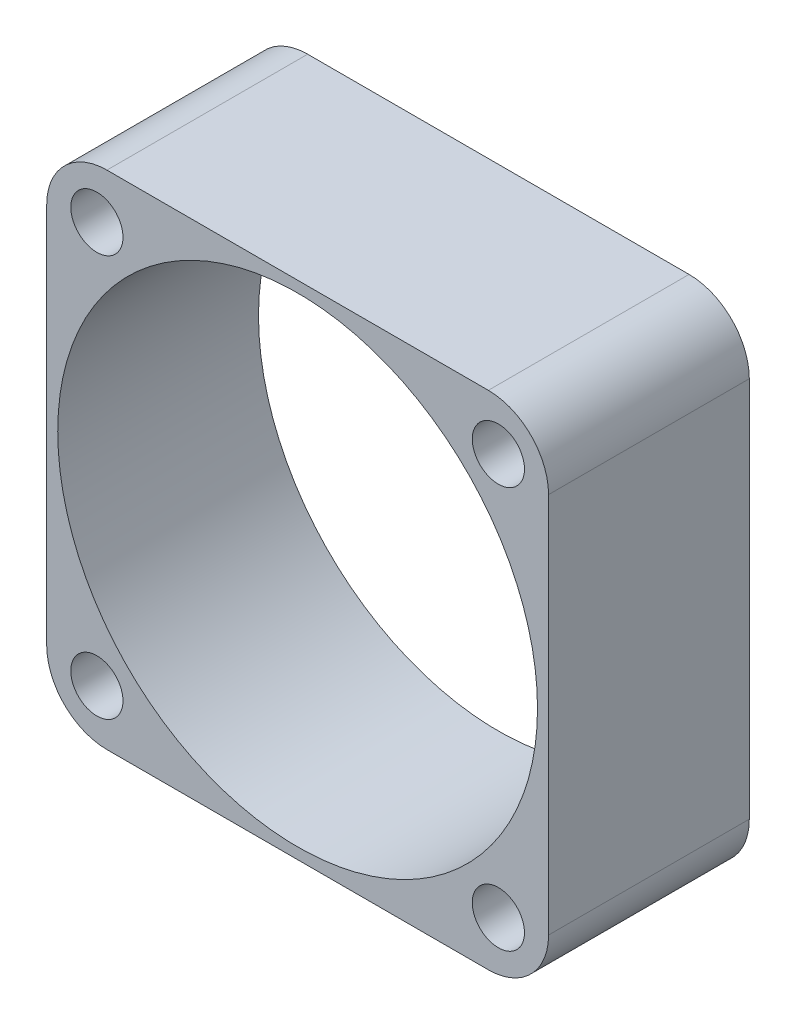
ISO-10303-21;
HEADER;
FILE_DESCRIPTION(('STEP AP214'),'2;1');
FILE_NAME('part.step','',(''),(''),'','','');
FILE_SCHEMA(('AUTOMOTIVE_DESIGN { 1 0 10303 214 1 1 1 1 }'));
ENDSEC;
DATA;
#1=APPLICATION_CONTEXT('core data for automotive mechanical design processes');
#2=APPLICATION_PROTOCOL_DEFINITION('international standard','automotive_design',2000,#1);
#3=PRODUCT_CONTEXT('',#1,'mechanical');
#4=PRODUCT('Part','Part','',(#3));
#5=PRODUCT_RELATED_PRODUCT_CATEGORY('part','',(#4));
#6=PRODUCT_DEFINITION_FORMATION('','',#4);
#7=PRODUCT_DEFINITION_CONTEXT('part definition',#1,'design');
#8=PRODUCT_DEFINITION('design','',#6,#7);
#9=PRODUCT_DEFINITION_SHAPE('','',#8);
#10=(LENGTH_UNIT() NAMED_UNIT(*) SI_UNIT(.MILLI.,.METRE.));
#11=(NAMED_UNIT(*) PLANE_ANGLE_UNIT() SI_UNIT($,.RADIAN.));
#12=(NAMED_UNIT(*) SI_UNIT($,.STERADIAN.) SOLID_ANGLE_UNIT());
#13=UNCERTAINTY_MEASURE_WITH_UNIT(LENGTH_MEASURE(1.E-05),#10,'distance_accuracy_value','');
#14=(GEOMETRIC_REPRESENTATION_CONTEXT(3) GLOBAL_UNCERTAINTY_ASSIGNED_CONTEXT((#13)) GLOBAL_UNIT_ASSIGNED_CONTEXT((#10,
#11,#12)) REPRESENTATION_CONTEXT('',''));
#15=CARTESIAN_POINT('',(0.,0.,0.));
#16=DIRECTION('',(0.,0.,1.));
#17=DIRECTION('',(1.,0.,0.));
#18=AXIS2_PLACEMENT_3D('',#15,#16,#17);
#19=CARTESIAN_POINT('',(-12.8241937913114,-87.6141399514316,10.));
#20=DIRECTION('',(-1.,0.,0.));
#21=DIRECTION('',(0.,0.,1.));
#22=AXIS2_PLACEMENT_3D('',#19,#20,#21);
#23=PLANE('',#22);
#24=DIRECTION('',(0.,1.,0.));
#25=VECTOR('',#24,1.);
#26=CARTESIAN_POINT('',(-12.8241937913114,-87.6141399514316,10.));
#27=LINE('',#26,#25);
#28=CARTESIAN_POINT('',(-12.8241937913114,-84.6141399514316,10.));
#29=VERTEX_POINT('',#28);
#30=CARTESIAN_POINT('',(-12.8241937913114,-65.6141399514316,10.));
#31=VERTEX_POINT('',#30);
#32=EDGE_CURVE('E122',#29,#31,#27,.T.);
#33=ORIENTED_EDGE('',*,*,#32,.F.);
#34=DIRECTION('',(0.,0.,-1.));
#35=VECTOR('',#34,1.);
#36=CARTESIAN_POINT('',(-12.8241937913114,-84.6141399514316,10.));
#37=LINE('',#36,#35);
#38=CARTESIAN_POINT('',(-12.8241937913114,-84.6141399514316,0.));
#39=VERTEX_POINT('',#38);
#40=EDGE_CURVE('E107',#29,#39,#37,.T.);
#41=ORIENTED_EDGE('',*,*,#40,.T.);
#42=DIRECTION('',(0.,1.,0.));
#43=VECTOR('',#42,1.);
#44=CARTESIAN_POINT('',(-12.8241937913114,-87.6141399514316,0.));
#45=LINE('',#44,#43);
#46=CARTESIAN_POINT('',(-12.8241937913114,-65.6141399514316,0.));
#47=VERTEX_POINT('',#46);
#48=EDGE_CURVE('E119',#39,#47,#45,.T.);
#49=ORIENTED_EDGE('',*,*,#48,.T.);
#50=DIRECTION('',(0.,0.,-1.));
#51=VECTOR('',#50,1.);
#52=CARTESIAN_POINT('',(-12.8241937913114,-65.6141399514316,10.));
#53=LINE('',#52,#51);
#54=EDGE_CURVE('E124',#47,#31,#53,.F.);
#55=ORIENTED_EDGE('',*,*,#54,.T.);
#56=EDGE_LOOP('',(#33,#41,#49,#55));
#57=FACE_BOUND('',#56,.T.);
#58=ADVANCED_FACE('F37',(#57),#23,.F.);
#59=CARTESIAN_POINT('',(-12.8241937913114,-62.6141399514316,10.));
#60=DIRECTION('',(0.,-1.,0.));
#61=DIRECTION('',(1.,0.,0.));
#62=AXIS2_PLACEMENT_3D('',#59,#60,#61);
#63=PLANE('',#62);
#64=DIRECTION('',(-1.,0.,0.));
#65=VECTOR('',#64,1.);
#66=CARTESIAN_POINT('',(-12.8241937913114,-62.6141399514316,10.));
#67=LINE('',#66,#65);
#68=CARTESIAN_POINT('',(-15.8241937913114,-62.6141399514316,10.));
#69=VERTEX_POINT('',#68);
#70=CARTESIAN_POINT('',(-34.8241937913114,-62.6141399514315,10.));
#71=VERTEX_POINT('',#70);
#72=EDGE_CURVE('E168',#69,#71,#67,.T.);
#73=ORIENTED_EDGE('',*,*,#72,.F.);
#74=DIRECTION('',(0.,0.,-1.));
#75=VECTOR('',#74,1.);
#76=CARTESIAN_POINT('',(-15.8241937913114,-62.6141399514316,10.));
#77=LINE('',#76,#75);
#78=CARTESIAN_POINT('',(-15.8241937913114,-62.6141399514316,0.));
#79=VERTEX_POINT('',#78);
#80=EDGE_CURVE('E161',#69,#79,#77,.T.);
#81=ORIENTED_EDGE('',*,*,#80,.T.);
#82=DIRECTION('',(-1.,0.,0.));
#83=VECTOR('',#82,1.);
#84=CARTESIAN_POINT('',(-12.8241937913114,-62.6141399514316,0.));
#85=LINE('',#84,#83);
#86=CARTESIAN_POINT('',(-34.8241937913114,-62.6141399514315,0.));
#87=VERTEX_POINT('',#86);
#88=EDGE_CURVE('E128',#79,#87,#85,.T.);
#89=ORIENTED_EDGE('',*,*,#88,.T.);
#90=DIRECTION('',(0.,0.,-1.));
#91=VECTOR('',#90,1.);
#92=CARTESIAN_POINT('',(-34.8241937913114,-62.6141399514315,10.));
#93=LINE('',#92,#91);
#94=EDGE_CURVE('E159',#87,#71,#93,.F.);
#95=ORIENTED_EDGE('',*,*,#94,.T.);
#96=EDGE_LOOP('',(#73,#81,#89,#95));
#97=FACE_BOUND('',#96,.T.);
#98=ADVANCED_FACE('F166',(#97),#63,.F.);
#99=CARTESIAN_POINT('',(-37.8241937913114,-87.6141399514316,10.));
#100=DIRECTION('',(1.,0.,0.));
#101=DIRECTION('',(0.,0.,-1.));
#102=AXIS2_PLACEMENT_3D('',#99,#100,#101);
#103=PLANE('',#102);
#104=DIRECTION('',(0.,-1.,0.));
#105=VECTOR('',#104,1.);
#106=CARTESIAN_POINT('',(-37.8241937913114,-87.6141399514316,10.));
#107=LINE('',#106,#105);
#108=CARTESIAN_POINT('',(-37.8241937913114,-65.6141399514315,10.));
#109=VERTEX_POINT('',#108);
#110=CARTESIAN_POINT('',(-37.8241937913114,-84.6141399514316,10.));
#111=VERTEX_POINT('',#110);
#112=EDGE_CURVE('E176',#109,#111,#107,.T.);
#113=ORIENTED_EDGE('',*,*,#112,.F.);
#114=DIRECTION('',(0.,0.,-1.));
#115=VECTOR('',#114,1.);
#116=CARTESIAN_POINT('',(-37.8241937913114,-65.6141399514315,10.));
#117=LINE('',#116,#115);
#118=CARTESIAN_POINT('',(-37.8241937913114,-65.6141399514315,0.));
#119=VERTEX_POINT('',#118);
#120=EDGE_CURVE('E11',#109,#119,#117,.T.);
#121=ORIENTED_EDGE('',*,*,#120,.T.);
#122=DIRECTION('',(0.,-1.,0.));
#123=VECTOR('',#122,1.);
#124=CARTESIAN_POINT('',(-37.8241937913114,-87.6141399514316,0.));
#125=LINE('',#124,#123);
#126=CARTESIAN_POINT('',(-37.8241937913114,-84.6141399514316,0.));
#127=VERTEX_POINT('',#126);
#128=EDGE_CURVE('E132',#119,#127,#125,.T.);
#129=ORIENTED_EDGE('',*,*,#128,.T.);
#130=DIRECTION('',(0.,0.,-1.));
#131=VECTOR('',#130,1.);
#132=CARTESIAN_POINT('',(-37.8241937913114,-84.6141399514316,10.));
#133=LINE('',#132,#131);
#134=EDGE_CURVE('E45',#127,#111,#133,.F.);
#135=ORIENTED_EDGE('',*,*,#134,.T.);
#136=EDGE_LOOP('',(#113,#121,#129,#135));
#137=FACE_BOUND('',#136,.T.);
#138=ADVANCED_FACE('F175',(#137),#103,.F.);
#139=CARTESIAN_POINT('',(-12.8241937913114,-87.6141399514316,10.));
#140=DIRECTION('',(0.,1.,0.));
#141=DIRECTION('',(0.,0.,1.));
#142=AXIS2_PLACEMENT_3D('',#139,#140,#141);
#143=PLANE('',#142);
#144=DIRECTION('',(1.,0.,0.));
#145=VECTOR('',#144,1.);
#146=CARTESIAN_POINT('',(-12.8241937913114,-87.6141399514316,0.));
#147=LINE('',#146,#145);
#148=CARTESIAN_POINT('',(-34.8241937913114,-87.6141399514316,0.));
#149=VERTEX_POINT('',#148);
#150=CARTESIAN_POINT('',(-15.8241937913114,-87.6141399514316,0.));
#151=VERTEX_POINT('',#150);
#152=EDGE_CURVE('E142',#149,#151,#147,.T.);
#153=ORIENTED_EDGE('',*,*,#152,.T.);
#154=DIRECTION('',(0.,0.,-1.));
#155=VECTOR('',#154,1.);
#156=CARTESIAN_POINT('',(-15.8241937913114,-87.6141399514316,10.));
#157=LINE('',#156,#155);
#158=CARTESIAN_POINT('',(-15.8241937913114,-87.6141399514316,10.));
#159=VERTEX_POINT('',#158);
#160=EDGE_CURVE('E108',#151,#159,#157,.F.);
#161=ORIENTED_EDGE('',*,*,#160,.T.);
#162=DIRECTION('',(1.,0.,0.));
#163=VECTOR('',#162,1.);
#164=CARTESIAN_POINT('',(-12.8241937913114,-87.6141399514316,10.));
#165=LINE('',#164,#163);
#166=CARTESIAN_POINT('',(-34.8241937913114,-87.6141399514316,10.));
#167=VERTEX_POINT('',#166);
#168=EDGE_CURVE('E138',#167,#159,#165,.T.);
#169=ORIENTED_EDGE('',*,*,#168,.F.);
#170=DIRECTION('',(0.,0.,-1.));
#171=VECTOR('',#170,1.);
#172=CARTESIAN_POINT('',(-34.8241937913114,-87.6141399514316,10.));
#173=LINE('',#172,#171);
#174=EDGE_CURVE('E113',#167,#149,#173,.T.);
#175=ORIENTED_EDGE('',*,*,#174,.T.);
#176=EDGE_LOOP('',(#153,#161,#169,#175));
#177=FACE_BOUND('',#176,.T.);
#178=ADVANCED_FACE('F221',(#177),#143,.F.);
#179=CARTESIAN_POINT('',(0.,0.,10.));
#180=DIRECTION('',(0.,0.,1.));
#181=DIRECTION('',(1.,0.,0.));
#182=AXIS2_PLACEMENT_3D('',#179,#180,#181);
#183=PLANE('',#182);
#184=CARTESIAN_POINT('',(-25.3241937913114,-75.1141399514315,10.));
#185=DIRECTION('',(0.,0.,1.));
#186=DIRECTION('',(1.,0.,0.));
#187=AXIS2_PLACEMENT_3D('',#184,#185,#186);
#188=CIRCLE('',#187,11.95);
#189=CARTESIAN_POINT('',(-13.3741937913114,-75.1141399514315,10.));
#190=VERTEX_POINT('',#189);
#191=EDGE_CURVE('E203',#190,#190,#188,.T.);
#192=ORIENTED_EDGE('',*,*,#191,.F.);
#193=EDGE_LOOP('',(#192));
#194=FACE_BOUND('',#193,.T.);
#195=CARTESIAN_POINT('',(-35.3241937913114,-85.1141399514316,10.));
#196=DIRECTION('',(0.,0.,1.));
#197=DIRECTION('',(1.,0.,0.));
#198=AXIS2_PLACEMENT_3D('',#195,#196,#197);
#199=CIRCLE('',#198,1.30000000000001);
#200=CARTESIAN_POINT('',(-34.0241937913114,-85.1141399514316,10.));
#201=VERTEX_POINT('',#200);
#202=EDGE_CURVE('E194',#201,#201,#199,.T.);
#203=ORIENTED_EDGE('',*,*,#202,.F.);
#204=EDGE_LOOP('',(#203));
#205=FACE_BOUND('',#204,.T.);
#206=CARTESIAN_POINT('',(-35.3241937913114,-65.1141399514315,10.));
#207=DIRECTION('',(0.,0.,1.));
#208=DIRECTION('',(1.,0.,0.));
#209=AXIS2_PLACEMENT_3D('',#206,#207,#208);
#210=CIRCLE('',#209,1.30000000000001);
#211=CARTESIAN_POINT('',(-34.0241937913114,-65.1141399514315,10.));
#212=VERTEX_POINT('',#211);
#213=EDGE_CURVE('E188',#212,#212,#210,.T.);
#214=ORIENTED_EDGE('',*,*,#213,.F.);
#215=EDGE_LOOP('',(#214));
#216=FACE_BOUND('',#215,.T.);
#217=CARTESIAN_POINT('',(-15.3241937913114,-65.1141399514315,10.));
#218=DIRECTION('',(0.,0.,1.));
#219=DIRECTION('',(1.,0.,0.));
#220=AXIS2_PLACEMENT_3D('',#217,#218,#219);
#221=CIRCLE('',#220,1.29999999999999);
#222=CARTESIAN_POINT('',(-14.0241937913114,-65.1141399514315,10.));
#223=VERTEX_POINT('',#222);
#224=EDGE_CURVE('E183',#223,#223,#221,.T.);
#225=ORIENTED_EDGE('',*,*,#224,.F.);
#226=EDGE_LOOP('',(#225));
#227=FACE_BOUND('',#226,.T.);
#228=CARTESIAN_POINT('',(-15.3241937913114,-85.1141399514316,10.));
#229=DIRECTION('',(0.,0.,1.));
#230=DIRECTION('',(1.,0.,0.));
#231=AXIS2_PLACEMENT_3D('',#228,#229,#230);
#232=CIRCLE('',#231,1.29999999999999);
#233=CARTESIAN_POINT('',(-14.0241937913114,-85.1141399514316,10.));
#234=VERTEX_POINT('',#233);
#235=EDGE_CURVE('E135',#234,#234,#232,.T.);
#236=ORIENTED_EDGE('',*,*,#235,.F.);
#237=EDGE_LOOP('',(#236));
#238=FACE_BOUND('',#237,.T.);
#239=ORIENTED_EDGE('',*,*,#168,.T.);
#240=CARTESIAN_POINT('',(-15.8241937913114,-84.6141399514316,10.));
#241=DIRECTION('',(0.,0.,1.));
#242=DIRECTION('',(1.,0.,0.));
#243=AXIS2_PLACEMENT_3D('',#240,#241,#242);
#244=CIRCLE('',#243,3.);
#245=EDGE_CURVE('E157',#159,#29,#244,.T.);
#246=ORIENTED_EDGE('',*,*,#245,.T.);
#247=ORIENTED_EDGE('',*,*,#32,.T.);
#248=CARTESIAN_POINT('',(-15.8241937913114,-65.6141399514316,10.));
#249=DIRECTION('',(0.,0.,1.));
#250=DIRECTION('',(1.,0.,0.));
#251=AXIS2_PLACEMENT_3D('',#248,#249,#250);
#252=CIRCLE('',#251,3.);
#253=EDGE_CURVE('E155',#31,#69,#252,.T.);
#254=ORIENTED_EDGE('',*,*,#253,.T.);
#255=ORIENTED_EDGE('',*,*,#72,.T.);
#256=CARTESIAN_POINT('',(-34.8241937913114,-65.6141399514315,10.));
#257=DIRECTION('',(0.,0.,1.));
#258=DIRECTION('',(1.,0.,0.));
#259=AXIS2_PLACEMENT_3D('',#256,#257,#258);
#260=CIRCLE('',#259,3.);
#261=EDGE_CURVE('E58',#71,#109,#260,.T.);
#262=ORIENTED_EDGE('',*,*,#261,.T.);
#263=ORIENTED_EDGE('',*,*,#112,.T.);
#264=CARTESIAN_POINT('',(-34.8241937913114,-84.6141399514316,10.));
#265=DIRECTION('',(0.,0.,1.));
#266=DIRECTION('',(1.,0.,0.));
#267=AXIS2_PLACEMENT_3D('',#264,#265,#266);
#268=CIRCLE('',#267,3.);
#269=EDGE_CURVE('E152',#111,#167,#268,.T.);
#270=ORIENTED_EDGE('',*,*,#269,.T.);
#271=EDGE_LOOP('',(#239,#246,#247,#254,#255,#262,#263,#270));
#272=FACE_BOUND('',#271,.T.);
#273=ADVANCED_FACE('F218',(#194,#205,#216,#227,#238,#272),#183,.T.);
#274=CARTESIAN_POINT('',(0.,0.,0.));
#275=DIRECTION('',(0.,0.,1.));
#276=DIRECTION('',(1.,0.,0.));
#277=AXIS2_PLACEMENT_3D('',#274,#275,#276);
#278=PLANE('',#277);
#279=CARTESIAN_POINT('',(-25.3241937913114,-75.1141399514315,0.));
#280=DIRECTION('',(0.,0.,1.));
#281=DIRECTION('',(1.,0.,0.));
#282=AXIS2_PLACEMENT_3D('',#279,#280,#281);
#283=CIRCLE('',#282,11.95);
#284=CARTESIAN_POINT('',(-13.3741937913114,-75.1141399514315,0.));
#285=VERTEX_POINT('',#284);
#286=EDGE_CURVE('E200',#285,#285,#283,.T.);
#287=ORIENTED_EDGE('',*,*,#286,.T.);
#288=EDGE_LOOP('',(#287));
#289=FACE_BOUND('',#288,.T.);
#290=CARTESIAN_POINT('',(-35.3241937913114,-85.1141399514316,0.));
#291=DIRECTION('',(0.,0.,1.));
#292=DIRECTION('',(1.,0.,0.));
#293=AXIS2_PLACEMENT_3D('',#290,#291,#292);
#294=CIRCLE('',#293,1.30000000000001);
#295=CARTESIAN_POINT('',(-34.0241937913114,-85.1141399514316,0.));
#296=VERTEX_POINT('',#295);
#297=EDGE_CURVE('E197',#296,#296,#294,.T.);
#298=ORIENTED_EDGE('',*,*,#297,.T.);
#299=EDGE_LOOP('',(#298));
#300=FACE_BOUND('',#299,.T.);
#301=CARTESIAN_POINT('',(-35.3241937913114,-65.1141399514315,0.));
#302=DIRECTION('',(0.,0.,1.));
#303=DIRECTION('',(1.,0.,0.));
#304=AXIS2_PLACEMENT_3D('',#301,#302,#303);
#305=CIRCLE('',#304,1.30000000000001);
#306=CARTESIAN_POINT('',(-34.0241937913114,-65.1141399514315,0.));
#307=VERTEX_POINT('',#306);
#308=EDGE_CURVE('E191',#307,#307,#305,.T.);
#309=ORIENTED_EDGE('',*,*,#308,.T.);
#310=EDGE_LOOP('',(#309));
#311=FACE_BOUND('',#310,.T.);
#312=CARTESIAN_POINT('',(-15.3241937913114,-65.1141399514315,0.));
#313=DIRECTION('',(0.,0.,1.));
#314=DIRECTION('',(1.,0.,0.));
#315=AXIS2_PLACEMENT_3D('',#312,#313,#314);
#316=CIRCLE('',#315,1.29999999999999);
#317=CARTESIAN_POINT('',(-14.0241937913114,-65.1141399514315,0.));
#318=VERTEX_POINT('',#317);
#319=EDGE_CURVE('E185',#318,#318,#316,.T.);
#320=ORIENTED_EDGE('',*,*,#319,.T.);
#321=EDGE_LOOP('',(#320));
#322=FACE_BOUND('',#321,.T.);
#323=CARTESIAN_POINT('',(-15.3241937913114,-85.1141399514316,0.));
#324=DIRECTION('',(0.,0.,1.));
#325=DIRECTION('',(1.,0.,0.));
#326=AXIS2_PLACEMENT_3D('',#323,#324,#325);
#327=CIRCLE('',#326,1.29999999999999);
#328=CARTESIAN_POINT('',(-14.0241937913114,-85.1141399514316,0.));
#329=VERTEX_POINT('',#328);
#330=EDGE_CURVE('E129',#329,#329,#327,.T.);
#331=ORIENTED_EDGE('',*,*,#330,.T.);
#332=EDGE_LOOP('',(#331));
#333=FACE_BOUND('',#332,.T.);
#334=ORIENTED_EDGE('',*,*,#48,.F.);
#335=CARTESIAN_POINT('',(-15.8241937913114,-84.6141399514316,0.));
#336=DIRECTION('',(0.,0.,1.));
#337=DIRECTION('',(1.,0.,0.));
#338=AXIS2_PLACEMENT_3D('',#335,#336,#337);
#339=CIRCLE('',#338,3.);
#340=EDGE_CURVE('E103',#39,#151,#339,.F.);
#341=ORIENTED_EDGE('',*,*,#340,.T.);
#342=ORIENTED_EDGE('',*,*,#152,.F.);
#343=CARTESIAN_POINT('',(-34.8241937913114,-84.6141399514316,0.));
#344=DIRECTION('',(0.,0.,1.));
#345=DIRECTION('',(1.,0.,0.));
#346=AXIS2_PLACEMENT_3D('',#343,#344,#345);
#347=CIRCLE('',#346,3.);
#348=EDGE_CURVE('E123',#149,#127,#347,.F.);
#349=ORIENTED_EDGE('',*,*,#348,.T.);
#350=ORIENTED_EDGE('',*,*,#128,.F.);
#351=CARTESIAN_POINT('',(-34.8241937913114,-65.6141399514315,0.));
#352=DIRECTION('',(0.,0.,1.));
#353=DIRECTION('',(1.,0.,0.));
#354=AXIS2_PLACEMENT_3D('',#351,#352,#353);
#355=CIRCLE('',#354,3.);
#356=EDGE_CURVE('E146',#119,#87,#355,.F.);
#357=ORIENTED_EDGE('',*,*,#356,.T.);
#358=ORIENTED_EDGE('',*,*,#88,.F.);
#359=CARTESIAN_POINT('',(-15.8241937913114,-65.6141399514316,0.));
#360=DIRECTION('',(0.,0.,1.));
#361=DIRECTION('',(1.,0.,0.));
#362=AXIS2_PLACEMENT_3D('',#359,#360,#361);
#363=CIRCLE('',#362,3.);
#364=EDGE_CURVE('E114',#79,#47,#363,.F.);
#365=ORIENTED_EDGE('',*,*,#364,.T.);
#366=EDGE_LOOP('',(#334,#341,#342,#349,#350,#357,#358,#365));
#367=FACE_BOUND('',#366,.T.);
#368=ADVANCED_FACE('F126',(#289,#300,#311,#322,#333,#367),#278,.F.);
#369=CARTESIAN_POINT('',(-15.8241937913114,-84.6141399514316,10.));
#370=DIRECTION('',(0.,0.,-1.));
#371=DIRECTION('',(-1.,0.,0.));
#372=AXIS2_PLACEMENT_3D('',#369,#370,#371);
#373=CYLINDRICAL_SURFACE('',#372,3.);
#374=ORIENTED_EDGE('',*,*,#245,.F.);
#375=ORIENTED_EDGE('',*,*,#160,.F.);
#376=ORIENTED_EDGE('',*,*,#340,.F.);
#377=ORIENTED_EDGE('',*,*,#40,.F.);
#378=EDGE_LOOP('',(#374,#375,#376,#377));
#379=FACE_BOUND('',#378,.T.);
#380=ADVANCED_FACE('F106',(#379),#373,.T.);
#381=CARTESIAN_POINT('',(-15.8241937913114,-65.6141399514316,10.));
#382=DIRECTION('',(0.,0.,-1.));
#383=DIRECTION('',(-1.,0.,0.));
#384=AXIS2_PLACEMENT_3D('',#381,#382,#383);
#385=CYLINDRICAL_SURFACE('',#384,3.);
#386=ORIENTED_EDGE('',*,*,#253,.F.);
#387=ORIENTED_EDGE('',*,*,#54,.F.);
#388=ORIENTED_EDGE('',*,*,#364,.F.);
#389=ORIENTED_EDGE('',*,*,#80,.F.);
#390=EDGE_LOOP('',(#386,#387,#388,#389));
#391=FACE_BOUND('',#390,.T.);
#392=ADVANCED_FACE('F243',(#391),#385,.T.);
#393=CARTESIAN_POINT('',(-34.8241937913114,-65.6141399514315,10.));
#394=DIRECTION('',(0.,0.,-1.));
#395=DIRECTION('',(-1.,0.,0.));
#396=AXIS2_PLACEMENT_3D('',#393,#394,#395);
#397=CYLINDRICAL_SURFACE('',#396,3.);
#398=ORIENTED_EDGE('',*,*,#261,.F.);
#399=ORIENTED_EDGE('',*,*,#94,.F.);
#400=ORIENTED_EDGE('',*,*,#356,.F.);
#401=ORIENTED_EDGE('',*,*,#120,.F.);
#402=EDGE_LOOP('',(#398,#399,#400,#401));
#403=FACE_BOUND('',#402,.T.);
#404=ADVANCED_FACE('F174',(#403),#397,.T.);
#405=CARTESIAN_POINT('',(-34.8241937913114,-84.6141399514316,10.));
#406=DIRECTION('',(0.,0.,-1.));
#407=DIRECTION('',(-1.,0.,0.));
#408=AXIS2_PLACEMENT_3D('',#405,#406,#407);
#409=CYLINDRICAL_SURFACE('',#408,3.);
#410=ORIENTED_EDGE('',*,*,#269,.F.);
#411=ORIENTED_EDGE('',*,*,#134,.F.);
#412=ORIENTED_EDGE('',*,*,#348,.F.);
#413=ORIENTED_EDGE('',*,*,#174,.F.);
#414=EDGE_LOOP('',(#410,#411,#412,#413));
#415=FACE_BOUND('',#414,.T.);
#416=ADVANCED_FACE('F39',(#415),#409,.T.);
#417=CARTESIAN_POINT('',(-15.3241937913114,-85.1141399514316,0.));
#418=DIRECTION('',(0.,0.,1.));
#419=DIRECTION('',(1.,0.,0.));
#420=AXIS2_PLACEMENT_3D('',#417,#418,#419);
#421=CYLINDRICAL_SURFACE('',#420,1.29999999999999);
#422=ORIENTED_EDGE('',*,*,#330,.F.);
#423=EDGE_LOOP('',(#422));
#424=FACE_BOUND('',#423,.T.);
#425=ORIENTED_EDGE('',*,*,#235,.T.);
#426=EDGE_LOOP('',(#425));
#427=FACE_BOUND('',#426,.T.);
#428=ADVANCED_FACE('F235',(#424,#427),#421,.F.);
#429=CARTESIAN_POINT('',(-15.3241937913114,-65.1141399514315,0.));
#430=DIRECTION('',(0.,0.,1.));
#431=DIRECTION('',(1.,0.,0.));
#432=AXIS2_PLACEMENT_3D('',#429,#430,#431);
#433=CYLINDRICAL_SURFACE('',#432,1.29999999999999);
#434=ORIENTED_EDGE('',*,*,#319,.F.);
#435=EDGE_LOOP('',(#434));
#436=FACE_BOUND('',#435,.T.);
#437=ORIENTED_EDGE('',*,*,#224,.T.);
#438=EDGE_LOOP('',(#437));
#439=FACE_BOUND('',#438,.T.);
#440=ADVANCED_FACE('F240',(#436,#439),#433,.F.);
#441=CARTESIAN_POINT('',(-35.3241937913114,-65.1141399514315,0.));
#442=DIRECTION('',(0.,0.,1.));
#443=DIRECTION('',(1.,0.,0.));
#444=AXIS2_PLACEMENT_3D('',#441,#442,#443);
#445=CYLINDRICAL_SURFACE('',#444,1.30000000000001);
#446=ORIENTED_EDGE('',*,*,#308,.F.);
#447=EDGE_LOOP('',(#446));
#448=FACE_BOUND('',#447,.T.);
#449=ORIENTED_EDGE('',*,*,#213,.T.);
#450=EDGE_LOOP('',(#449));
#451=FACE_BOUND('',#450,.T.);
#452=ADVANCED_FACE('F283',(#448,#451),#445,.F.);
#453=CARTESIAN_POINT('',(-35.3241937913114,-85.1141399514316,0.));
#454=DIRECTION('',(0.,0.,1.));
#455=DIRECTION('',(1.,0.,0.));
#456=AXIS2_PLACEMENT_3D('',#453,#454,#455);
#457=CYLINDRICAL_SURFACE('',#456,1.30000000000001);
#458=ORIENTED_EDGE('',*,*,#297,.F.);
#459=EDGE_LOOP('',(#458));
#460=FACE_BOUND('',#459,.T.);
#461=ORIENTED_EDGE('',*,*,#202,.T.);
#462=EDGE_LOOP('',(#461));
#463=FACE_BOUND('',#462,.T.);
#464=ADVANCED_FACE('F214',(#460,#463),#457,.F.);
#465=CARTESIAN_POINT('',(-25.3241937913114,-75.1141399514315,0.));
#466=DIRECTION('',(0.,0.,1.));
#467=DIRECTION('',(1.,0.,0.));
#468=AXIS2_PLACEMENT_3D('',#465,#466,#467);
#469=CYLINDRICAL_SURFACE('',#468,11.95);
#470=ORIENTED_EDGE('',*,*,#286,.F.);
#471=EDGE_LOOP('',(#470));
#472=FACE_BOUND('',#471,.T.);
#473=ORIENTED_EDGE('',*,*,#191,.T.);
#474=EDGE_LOOP('',(#473));
#475=FACE_BOUND('',#474,.T.);
#476=ADVANCED_FACE('F211',(#472,#475),#469,.F.);
#477=CLOSED_SHELL('',(#58,#98,#138,#178,#273,#368,#380,#392,#404,#416,#428,#440,#452,#464,#476));
#478=MANIFOLD_SOLID_BREP('B2',#477);
#479=ADVANCED_BREP_SHAPE_REPRESENTATION('',(#18,#478),#14);
#480=SHAPE_DEFINITION_REPRESENTATION(#9,#479);
ENDSEC;
END-ISO-10303-21;
